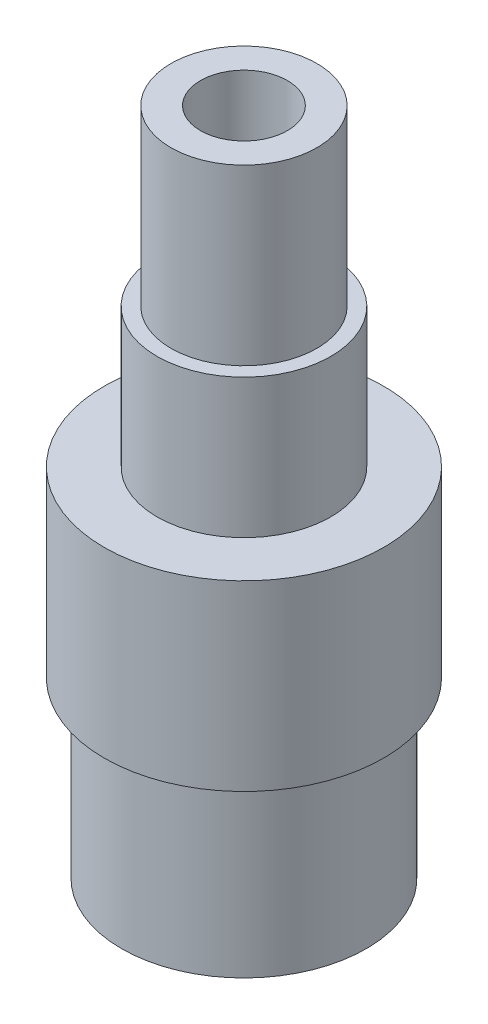
ISO-10303-21;
HEADER;
FILE_DESCRIPTION(('STEP AP214'),'2;1');
FILE_NAME('part.step','',(''),(''),'','','');
FILE_SCHEMA(('AUTOMOTIVE_DESIGN { 1 0 10303 214 1 1 1 1 }'));
ENDSEC;
DATA;
#1=APPLICATION_CONTEXT('core data for automotive mechanical design processes');
#2=APPLICATION_PROTOCOL_DEFINITION('international standard','automotive_design',2000,#1);
#3=PRODUCT_CONTEXT('',#1,'mechanical');
#4=PRODUCT('Part','Part','',(#3));
#5=PRODUCT_RELATED_PRODUCT_CATEGORY('part','',(#4));
#6=PRODUCT_DEFINITION_FORMATION('','',#4);
#7=PRODUCT_DEFINITION_CONTEXT('part definition',#1,'design');
#8=PRODUCT_DEFINITION('design','',#6,#7);
#9=PRODUCT_DEFINITION_SHAPE('','',#8);
#10=(LENGTH_UNIT() NAMED_UNIT(*) SI_UNIT(.MILLI.,.METRE.));
#11=(NAMED_UNIT(*) PLANE_ANGLE_UNIT() SI_UNIT($,.RADIAN.));
#12=(NAMED_UNIT(*) SI_UNIT($,.STERADIAN.) SOLID_ANGLE_UNIT());
#13=UNCERTAINTY_MEASURE_WITH_UNIT(LENGTH_MEASURE(1.E-05),#10,'distance_accuracy_value','');
#14=(GEOMETRIC_REPRESENTATION_CONTEXT(3) GLOBAL_UNCERTAINTY_ASSIGNED_CONTEXT((#13)) GLOBAL_UNIT_ASSIGNED_CONTEXT((#10,
#11,#12)) REPRESENTATION_CONTEXT('',''));
#15=CARTESIAN_POINT('',(0.,0.,0.));
#16=DIRECTION('',(0.,0.,1.));
#17=DIRECTION('',(1.,0.,0.));
#18=AXIS2_PLACEMENT_3D('',#15,#16,#17);
#19=CARTESIAN_POINT('',(0.,0.,0.));
#20=DIRECTION('',(0.,1.,0.));
#21=DIRECTION('',(0.,0.,1.));
#22=AXIS2_PLACEMENT_3D('',#19,#20,#21);
#23=CYLINDRICAL_SURFACE('',#22,3.175);
#24=CARTESIAN_POINT('',(0.,0.,0.));
#25=DIRECTION('',(0.,1.,0.));
#26=DIRECTION('',(0.,0.,1.));
#27=AXIS2_PLACEMENT_3D('',#24,#25,#26);
#28=CIRCLE('',#27,3.175);
#29=CARTESIAN_POINT('',(0.,0.,3.175));
#30=VERTEX_POINT('',#29);
#31=EDGE_CURVE('E10',#30,#30,#28,.T.);
#32=ORIENTED_EDGE('',*,*,#31,.T.);
#33=EDGE_LOOP('',(#32));
#34=FACE_BOUND('',#33,.T.);
#35=CARTESIAN_POINT('',(0.,-43.18,0.));
#36=DIRECTION('',(0.,1.,0.));
#37=DIRECTION('',(0.,0.,1.));
#38=AXIS2_PLACEMENT_3D('',#35,#36,#37);
#39=CIRCLE('',#38,3.175);
#40=CARTESIAN_POINT('',(0.,-43.18,3.175));
#41=VERTEX_POINT('',#40);
#42=EDGE_CURVE('E88',#41,#41,#39,.T.);
#43=ORIENTED_EDGE('',*,*,#42,.F.);
#44=EDGE_LOOP('',(#43));
#45=FACE_BOUND('',#44,.T.);
#46=ADVANCED_FACE('F37',(#34,#45),#23,.F.);
#47=CARTESIAN_POINT('',(-3.175,0.,0.));
#48=DIRECTION('',(0.,1.,0.));
#49=DIRECTION('',(0.,0.,1.));
#50=AXIS2_PLACEMENT_3D('',#47,#48,#49);
#51=PLANE('',#50);
#52=CARTESIAN_POINT('',(0.,0.,0.));
#53=DIRECTION('',(0.,1.,0.));
#54=DIRECTION('',(0.,0.,1.));
#55=AXIS2_PLACEMENT_3D('',#52,#53,#54);
#56=CIRCLE('',#55,5.334);
#57=CARTESIAN_POINT('',(0.,0.,5.334));
#58=VERTEX_POINT('',#57);
#59=EDGE_CURVE('E44',#58,#58,#56,.T.);
#60=ORIENTED_EDGE('',*,*,#59,.T.);
#61=EDGE_LOOP('',(#60));
#62=FACE_BOUND('',#61,.T.);
#63=ORIENTED_EDGE('',*,*,#31,.F.);
#64=EDGE_LOOP('',(#63));
#65=FACE_BOUND('',#64,.T.);
#66=ADVANCED_FACE('F97',(#62,#65),#51,.T.);
#67=CARTESIAN_POINT('',(0.,0.,0.));
#68=DIRECTION('',(0.,1.,0.));
#69=DIRECTION('',(0.,0.,1.));
#70=AXIS2_PLACEMENT_3D('',#67,#68,#69);
#71=CYLINDRICAL_SURFACE('',#70,5.334);
#72=CARTESIAN_POINT('',(0.,-12.7,0.));
#73=DIRECTION('',(0.,1.,0.));
#74=DIRECTION('',(0.,0.,1.));
#75=AXIS2_PLACEMENT_3D('',#72,#73,#74);
#76=CIRCLE('',#75,5.334);
#77=CARTESIAN_POINT('',(0.,-12.7,5.334));
#78=VERTEX_POINT('',#77);
#79=EDGE_CURVE('E49',#78,#78,#76,.T.);
#80=ORIENTED_EDGE('',*,*,#79,.T.);
#81=EDGE_LOOP('',(#80));
#82=FACE_BOUND('',#81,.T.);
#83=ORIENTED_EDGE('',*,*,#59,.F.);
#84=EDGE_LOOP('',(#83));
#85=FACE_BOUND('',#84,.T.);
#86=ADVANCED_FACE('F101',(#82,#85),#71,.T.);
#87=CARTESIAN_POINT('',(-5.334,-12.7,0.));
#88=DIRECTION('',(0.,1.,0.));
#89=DIRECTION('',(0.,0.,1.));
#90=AXIS2_PLACEMENT_3D('',#87,#88,#89);
#91=PLANE('',#90);
#92=CARTESIAN_POINT('',(0.,-12.7,0.));
#93=DIRECTION('',(0.,1.,0.));
#94=DIRECTION('',(0.,0.,1.));
#95=AXIS2_PLACEMENT_3D('',#92,#93,#94);
#96=CIRCLE('',#95,6.35);
#97=CARTESIAN_POINT('',(0.,-12.7,6.35));
#98=VERTEX_POINT('',#97);
#99=EDGE_CURVE('E54',#98,#98,#96,.T.);
#100=ORIENTED_EDGE('',*,*,#99,.T.);
#101=EDGE_LOOP('',(#100));
#102=FACE_BOUND('',#101,.T.);
#103=ORIENTED_EDGE('',*,*,#79,.F.);
#104=EDGE_LOOP('',(#103));
#105=FACE_BOUND('',#104,.T.);
#106=ADVANCED_FACE('F105',(#102,#105),#91,.T.);
#107=CARTESIAN_POINT('',(0.,0.,0.));
#108=DIRECTION('',(0.,1.,0.));
#109=DIRECTION('',(0.,0.,1.));
#110=AXIS2_PLACEMENT_3D('',#107,#108,#109);
#111=CYLINDRICAL_SURFACE('',#110,6.35);
#112=CARTESIAN_POINT('',(0.,-22.86,0.));
#113=DIRECTION('',(0.,1.,0.));
#114=DIRECTION('',(0.,0.,1.));
#115=AXIS2_PLACEMENT_3D('',#112,#113,#114);
#116=CIRCLE('',#115,6.35);
#117=CARTESIAN_POINT('',(0.,-22.86,6.35));
#118=VERTEX_POINT('',#117);
#119=EDGE_CURVE('E60',#118,#118,#116,.T.);
#120=ORIENTED_EDGE('',*,*,#119,.T.);
#121=EDGE_LOOP('',(#120));
#122=FACE_BOUND('',#121,.T.);
#123=ORIENTED_EDGE('',*,*,#99,.F.);
#124=EDGE_LOOP('',(#123));
#125=FACE_BOUND('',#124,.T.);
#126=ADVANCED_FACE('F112',(#122,#125),#111,.T.);
#127=CARTESIAN_POINT('',(-6.35,-22.86,0.));
#128=DIRECTION('',(0.,1.,0.));
#129=DIRECTION('',(0.,0.,1.));
#130=AXIS2_PLACEMENT_3D('',#127,#128,#129);
#131=PLANE('',#130);
#132=CARTESIAN_POINT('',(0.,-22.86,0.));
#133=DIRECTION('',(0.,1.,0.));
#134=DIRECTION('',(0.,0.,1.));
#135=AXIS2_PLACEMENT_3D('',#132,#133,#134);
#136=CIRCLE('',#135,10.2108);
#137=CARTESIAN_POINT('',(0.,-22.86,10.2108));
#138=VERTEX_POINT('',#137);
#139=EDGE_CURVE('E64',#138,#138,#136,.T.);
#140=ORIENTED_EDGE('',*,*,#139,.T.);
#141=EDGE_LOOP('',(#140));
#142=FACE_BOUND('',#141,.T.);
#143=ORIENTED_EDGE('',*,*,#119,.F.);
#144=EDGE_LOOP('',(#143));
#145=FACE_BOUND('',#144,.T.);
#146=ADVANCED_FACE('F116',(#142,#145),#131,.T.);
#147=CARTESIAN_POINT('',(0.,0.,0.));
#148=DIRECTION('',(0.,1.,0.));
#149=DIRECTION('',(0.,0.,1.));
#150=AXIS2_PLACEMENT_3D('',#147,#148,#149);
#151=CYLINDRICAL_SURFACE('',#150,10.2108);
#152=CARTESIAN_POINT('',(0.,-36.195,0.));
#153=DIRECTION('',(0.,1.,0.));
#154=DIRECTION('',(0.,0.,1.));
#155=AXIS2_PLACEMENT_3D('',#152,#153,#154);
#156=CIRCLE('',#155,10.2108);
#157=CARTESIAN_POINT('',(0.,-36.195,10.2108));
#158=VERTEX_POINT('',#157);
#159=EDGE_CURVE('E68',#158,#158,#156,.T.);
#160=ORIENTED_EDGE('',*,*,#159,.T.);
#161=EDGE_LOOP('',(#160));
#162=FACE_BOUND('',#161,.T.);
#163=ORIENTED_EDGE('',*,*,#139,.F.);
#164=EDGE_LOOP('',(#163));
#165=FACE_BOUND('',#164,.T.);
#166=ADVANCED_FACE('F120',(#162,#165),#151,.T.);
#167=CARTESIAN_POINT('',(-10.2108,-36.195,0.));
#168=DIRECTION('',(0.,-1.,0.));
#169=DIRECTION('',(0.,0.,-1.));
#170=AXIS2_PLACEMENT_3D('',#167,#168,#169);
#171=PLANE('',#170);
#172=CARTESIAN_POINT('',(0.,-36.195,0.));
#173=DIRECTION('',(0.,1.,0.));
#174=DIRECTION('',(0.,0.,1.));
#175=AXIS2_PLACEMENT_3D('',#172,#173,#174);
#176=CIRCLE('',#175,8.94079999999999);
#177=CARTESIAN_POINT('',(0.,-36.195,8.94079999999999));
#178=VERTEX_POINT('',#177);
#179=EDGE_CURVE('E72',#178,#178,#176,.T.);
#180=ORIENTED_EDGE('',*,*,#179,.T.);
#181=EDGE_LOOP('',(#180));
#182=FACE_BOUND('',#181,.T.);
#183=ORIENTED_EDGE('',*,*,#159,.F.);
#184=EDGE_LOOP('',(#183));
#185=FACE_BOUND('',#184,.T.);
#186=ADVANCED_FACE('F124',(#182,#185),#171,.T.);
#187=CARTESIAN_POINT('',(0.,0.,0.));
#188=DIRECTION('',(0.,1.,0.));
#189=DIRECTION('',(0.,0.,1.));
#190=AXIS2_PLACEMENT_3D('',#187,#188,#189);
#191=CYLINDRICAL_SURFACE('',#190,8.94079999999999);
#192=CARTESIAN_POINT('',(0.,-48.895,0.));
#193=DIRECTION('',(0.,1.,0.));
#194=DIRECTION('',(0.,0.,1.));
#195=AXIS2_PLACEMENT_3D('',#192,#193,#194);
#196=CIRCLE('',#195,8.94079999999999);
#197=CARTESIAN_POINT('',(0.,-48.895,8.94079999999999));
#198=VERTEX_POINT('',#197);
#199=EDGE_CURVE('E76',#198,#198,#196,.T.);
#200=ORIENTED_EDGE('',*,*,#199,.T.);
#201=EDGE_LOOP('',(#200));
#202=FACE_BOUND('',#201,.T.);
#203=ORIENTED_EDGE('',*,*,#179,.F.);
#204=EDGE_LOOP('',(#203));
#205=FACE_BOUND('',#204,.T.);
#206=ADVANCED_FACE('F128',(#202,#205),#191,.T.);
#207=CARTESIAN_POINT('',(-8.94079999999999,-48.895,0.));
#208=DIRECTION('',(0.,-1.,0.));
#209=DIRECTION('',(0.,0.,-1.));
#210=AXIS2_PLACEMENT_3D('',#207,#208,#209);
#211=PLANE('',#210);
#212=CARTESIAN_POINT('',(0.,-48.895,0.));
#213=DIRECTION('',(0.,1.,0.));
#214=DIRECTION('',(0.,0.,1.));
#215=AXIS2_PLACEMENT_3D('',#212,#213,#214);
#216=CIRCLE('',#215,4.445);
#217=CARTESIAN_POINT('',(0.,-48.895,4.445));
#218=VERTEX_POINT('',#217);
#219=EDGE_CURVE('E80',#218,#218,#216,.T.);
#220=ORIENTED_EDGE('',*,*,#219,.T.);
#221=EDGE_LOOP('',(#220));
#222=FACE_BOUND('',#221,.T.);
#223=ORIENTED_EDGE('',*,*,#199,.F.);
#224=EDGE_LOOP('',(#223));
#225=FACE_BOUND('',#224,.T.);
#226=ADVANCED_FACE('F132',(#222,#225),#211,.T.);
#227=CARTESIAN_POINT('',(0.,0.,0.));
#228=DIRECTION('',(0.,1.,0.));
#229=DIRECTION('',(0.,0.,1.));
#230=AXIS2_PLACEMENT_3D('',#227,#228,#229);
#231=CYLINDRICAL_SURFACE('',#230,4.445);
#232=CARTESIAN_POINT('',(0.,-43.18,0.));
#233=DIRECTION('',(0.,1.,0.));
#234=DIRECTION('',(0.,0.,1.));
#235=AXIS2_PLACEMENT_3D('',#232,#233,#234);
#236=CIRCLE('',#235,4.445);
#237=CARTESIAN_POINT('',(0.,-43.18,4.445));
#238=VERTEX_POINT('',#237);
#239=EDGE_CURVE('E84',#238,#238,#236,.T.);
#240=ORIENTED_EDGE('',*,*,#239,.T.);
#241=EDGE_LOOP('',(#240));
#242=FACE_BOUND('',#241,.T.);
#243=ORIENTED_EDGE('',*,*,#219,.F.);
#244=EDGE_LOOP('',(#243));
#245=FACE_BOUND('',#244,.T.);
#246=ADVANCED_FACE('F136',(#242,#245),#231,.F.);
#247=CARTESIAN_POINT('',(-4.445,-43.18,0.));
#248=DIRECTION('',(0.,-1.,0.));
#249=DIRECTION('',(0.,0.,-1.));
#250=AXIS2_PLACEMENT_3D('',#247,#248,#249);
#251=PLANE('',#250);
#252=ORIENTED_EDGE('',*,*,#42,.T.);
#253=EDGE_LOOP('',(#252));
#254=FACE_BOUND('',#253,.T.);
#255=ORIENTED_EDGE('',*,*,#239,.F.);
#256=EDGE_LOOP('',(#255));
#257=FACE_BOUND('',#256,.T.);
#258=ADVANCED_FACE('F93',(#254,#257),#251,.T.);
#259=CLOSED_SHELL('',(#46,#66,#86,#106,#126,#146,#166,#186,#206,#226,#246,#258));
#260=MANIFOLD_SOLID_BREP('B2',#259);
#261=ADVANCED_BREP_SHAPE_REPRESENTATION('',(#18,#260),#14);
#262=SHAPE_DEFINITION_REPRESENTATION(#9,#261);
ENDSEC;
END-ISO-10303-21;
